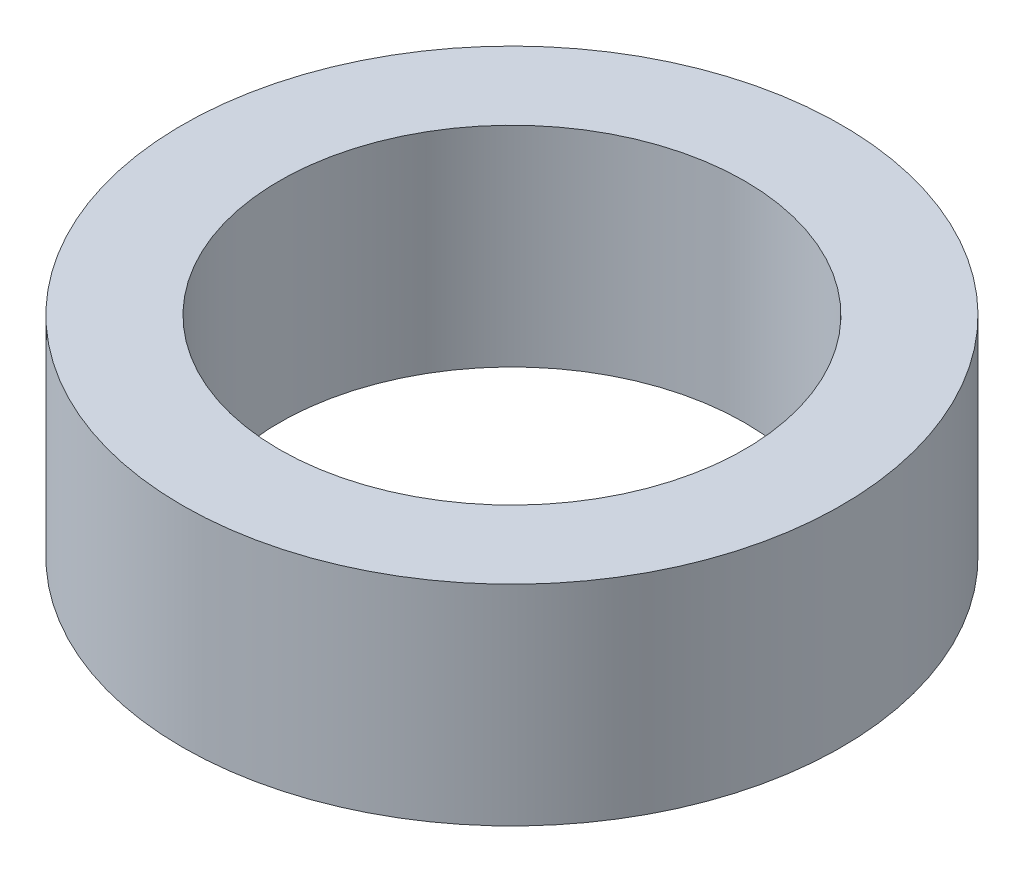
ISO-10303-21;
HEADER;
FILE_DESCRIPTION(('STEP AP214'),'2;1');
FILE_NAME('part.step','',(''),(''),'','','');
FILE_SCHEMA(('AUTOMOTIVE_DESIGN { 1 0 10303 214 1 1 1 1 }'));
ENDSEC;
DATA;
#1=APPLICATION_CONTEXT('core data for automotive mechanical design processes');
#2=APPLICATION_PROTOCOL_DEFINITION('international standard','automotive_design',2000,#1);
#3=PRODUCT_CONTEXT('',#1,'mechanical');
#4=PRODUCT('Part','Part','',(#3));
#5=PRODUCT_RELATED_PRODUCT_CATEGORY('part','',(#4));
#6=PRODUCT_DEFINITION_FORMATION('','',#4);
#7=PRODUCT_DEFINITION_CONTEXT('part definition',#1,'design');
#8=PRODUCT_DEFINITION('design','',#6,#7);
#9=PRODUCT_DEFINITION_SHAPE('','',#8);
#10=(LENGTH_UNIT() NAMED_UNIT(*) SI_UNIT(.MILLI.,.METRE.));
#11=(NAMED_UNIT(*) PLANE_ANGLE_UNIT() SI_UNIT($,.RADIAN.));
#12=(NAMED_UNIT(*) SI_UNIT($,.STERADIAN.) SOLID_ANGLE_UNIT());
#13=UNCERTAINTY_MEASURE_WITH_UNIT(LENGTH_MEASURE(1.E-05),#10,'distance_accuracy_value','');
#14=(GEOMETRIC_REPRESENTATION_CONTEXT(3) GLOBAL_UNCERTAINTY_ASSIGNED_CONTEXT((#13)) GLOBAL_UNIT_ASSIGNED_CONTEXT((#10,
#11,#12)) REPRESENTATION_CONTEXT('',''));
#15=CARTESIAN_POINT('',(0.,0.,0.));
#16=DIRECTION('',(0.,0.,1.));
#17=DIRECTION('',(1.,0.,0.));
#18=AXIS2_PLACEMENT_3D('',#15,#16,#17);
#19=CARTESIAN_POINT('',(0.,27.,0.));
#20=DIRECTION('',(0.,-1.,0.));
#21=DIRECTION('',(0.,0.,-1.));
#22=AXIS2_PLACEMENT_3D('',#19,#20,#21);
#23=CYLINDRICAL_SURFACE('',#22,42.5);
#24=CARTESIAN_POINT('',(0.,27.,0.));
#25=DIRECTION('',(0.,1.,0.));
#26=DIRECTION('',(0.,0.,1.));
#27=AXIS2_PLACEMENT_3D('',#24,#25,#26);
#28=CIRCLE('',#27,42.5);
#29=CARTESIAN_POINT('',(0.,27.,42.5));
#30=VERTEX_POINT('',#29);
#31=EDGE_CURVE('E10',#30,#30,#28,.T.);
#32=ORIENTED_EDGE('',*,*,#31,.F.);
#33=EDGE_LOOP('',(#32));
#34=FACE_BOUND('',#33,.T.);
#35=CARTESIAN_POINT('',(0.,0.,0.));
#36=DIRECTION('',(0.,1.,0.));
#37=DIRECTION('',(0.,0.,1.));
#38=AXIS2_PLACEMENT_3D('',#35,#36,#37);
#39=CIRCLE('',#38,42.5);
#40=CARTESIAN_POINT('',(0.,0.,42.5));
#41=VERTEX_POINT('',#40);
#42=EDGE_CURVE('E37',#41,#41,#39,.T.);
#43=ORIENTED_EDGE('',*,*,#42,.T.);
#44=EDGE_LOOP('',(#43));
#45=FACE_BOUND('',#44,.T.);
#46=ADVANCED_FACE('F40',(#34,#45),#23,.T.);
#47=CARTESIAN_POINT('',(0.,27.,0.));
#48=DIRECTION('',(0.,1.,0.));
#49=DIRECTION('',(0.,0.,1.));
#50=AXIS2_PLACEMENT_3D('',#47,#48,#49);
#51=PLANE('',#50);
#52=CARTESIAN_POINT('',(0.,27.,0.));
#53=DIRECTION('',(0.,1.,0.));
#54=DIRECTION('',(0.,0.,1.));
#55=AXIS2_PLACEMENT_3D('',#52,#53,#54);
#56=CIRCLE('',#55,30.);
#57=CARTESIAN_POINT('',(0.,27.,30.));
#58=VERTEX_POINT('',#57);
#59=EDGE_CURVE('E50',#58,#58,#56,.T.);
#60=ORIENTED_EDGE('',*,*,#59,.F.);
#61=EDGE_LOOP('',(#60));
#62=FACE_BOUND('',#61,.T.);
#63=ORIENTED_EDGE('',*,*,#31,.T.);
#64=EDGE_LOOP('',(#63));
#65=FACE_BOUND('',#64,.T.);
#66=ADVANCED_FACE('F59',(#62,#65),#51,.T.);
#67=CARTESIAN_POINT('',(0.,0.,0.));
#68=DIRECTION('',(0.,1.,0.));
#69=DIRECTION('',(0.,0.,1.));
#70=AXIS2_PLACEMENT_3D('',#67,#68,#69);
#71=PLANE('',#70);
#72=CARTESIAN_POINT('',(0.,0.,0.));
#73=DIRECTION('',(0.,1.,0.));
#74=DIRECTION('',(0.,0.,1.));
#75=AXIS2_PLACEMENT_3D('',#72,#73,#74);
#76=CIRCLE('',#75,30.);
#77=CARTESIAN_POINT('',(0.,0.,30.));
#78=VERTEX_POINT('',#77);
#79=EDGE_CURVE('E47',#78,#78,#76,.T.);
#80=ORIENTED_EDGE('',*,*,#79,.T.);
#81=EDGE_LOOP('',(#80));
#82=FACE_BOUND('',#81,.T.);
#83=ORIENTED_EDGE('',*,*,#42,.F.);
#84=EDGE_LOOP('',(#83));
#85=FACE_BOUND('',#84,.T.);
#86=ADVANCED_FACE('F58',(#82,#85),#71,.F.);
#87=CARTESIAN_POINT('',(0.,27.,0.));
#88=DIRECTION('',(0.,-1.,0.));
#89=DIRECTION('',(0.,0.,-1.));
#90=AXIS2_PLACEMENT_3D('',#87,#88,#89);
#91=CYLINDRICAL_SURFACE('',#90,30.);
#92=ORIENTED_EDGE('',*,*,#59,.T.);
#93=EDGE_LOOP('',(#92));
#94=FACE_BOUND('',#93,.T.);
#95=ORIENTED_EDGE('',*,*,#79,.F.);
#96=EDGE_LOOP('',(#95));
#97=FACE_BOUND('',#96,.T.);
#98=ADVANCED_FACE('F54',(#94,#97),#91,.F.);
#99=CLOSED_SHELL('',(#46,#66,#86,#98));
#100=MANIFOLD_SOLID_BREP('B2',#99);
#101=ADVANCED_BREP_SHAPE_REPRESENTATION('',(#18,#100),#14);
#102=SHAPE_DEFINITION_REPRESENTATION(#9,#101);
ENDSEC;
END-ISO-10303-21;
